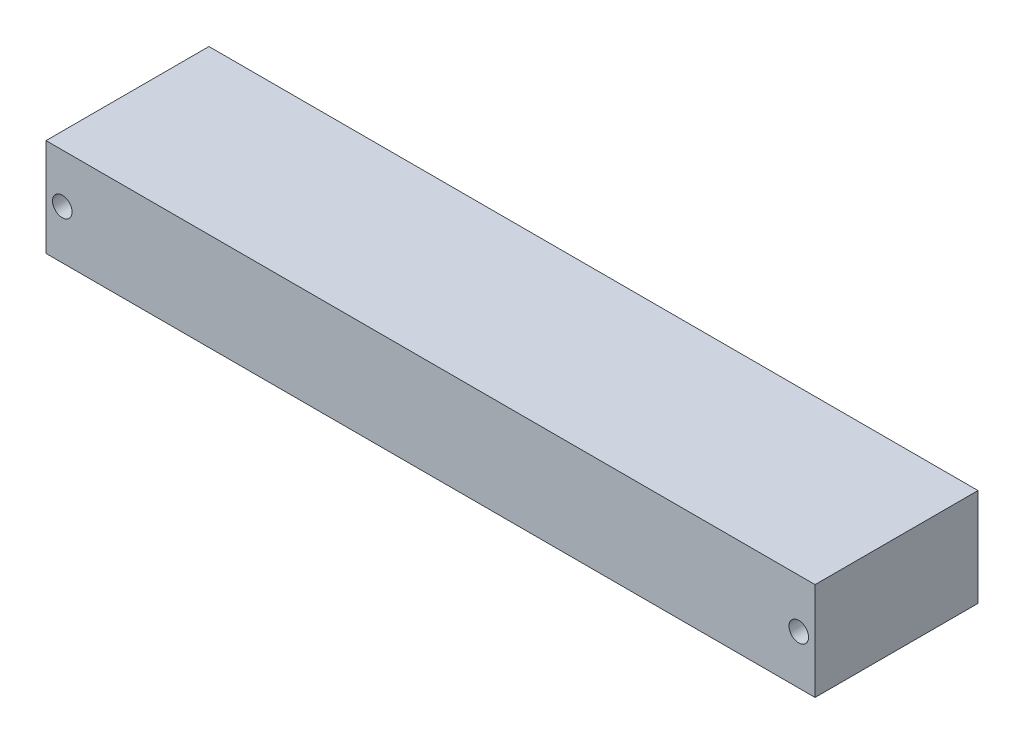
ISO-10303-21;
HEADER;
FILE_DESCRIPTION(('STEP AP214'),'2;1');
FILE_NAME('part.step','',(''),(''),'','','');
FILE_SCHEMA(('AUTOMOTIVE_DESIGN { 1 0 10303 214 1 1 1 1 }'));
ENDSEC;
DATA;
#1=APPLICATION_CONTEXT('core data for automotive mechanical design processes');
#2=APPLICATION_PROTOCOL_DEFINITION('international standard','automotive_design',2000,#1);
#3=PRODUCT_CONTEXT('',#1,'mechanical');
#4=PRODUCT('Part','Part','',(#3));
#5=PRODUCT_RELATED_PRODUCT_CATEGORY('part','',(#4));
#6=PRODUCT_DEFINITION_FORMATION('','',#4);
#7=PRODUCT_DEFINITION_CONTEXT('part definition',#1,'design');
#8=PRODUCT_DEFINITION('design','',#6,#7);
#9=PRODUCT_DEFINITION_SHAPE('','',#8);
#10=(LENGTH_UNIT() NAMED_UNIT(*) SI_UNIT(.MILLI.,.METRE.));
#11=(NAMED_UNIT(*) PLANE_ANGLE_UNIT() SI_UNIT($,.RADIAN.));
#12=(NAMED_UNIT(*) SI_UNIT($,.STERADIAN.) SOLID_ANGLE_UNIT());
#13=UNCERTAINTY_MEASURE_WITH_UNIT(LENGTH_MEASURE(1.E-05),#10,'distance_accuracy_value','');
#14=(GEOMETRIC_REPRESENTATION_CONTEXT(3) GLOBAL_UNCERTAINTY_ASSIGNED_CONTEXT((#13)) GLOBAL_UNIT_ASSIGNED_CONTEXT((#10,
#11,#12)) REPRESENTATION_CONTEXT('',''));
#15=CARTESIAN_POINT('',(0.,0.,0.));
#16=DIRECTION('',(0.,0.,1.));
#17=DIRECTION('',(1.,0.,0.));
#18=AXIS2_PLACEMENT_3D('',#15,#16,#17);
#19=CARTESIAN_POINT('',(59.,15.,-12.5));
#20=DIRECTION('',(-1.,0.,0.));
#21=DIRECTION('',(0.,0.,1.));
#22=AXIS2_PLACEMENT_3D('',#19,#20,#21);
#23=PLANE('',#22);
#24=DIRECTION('',(0.,0.,-1.));
#25=VECTOR('',#24,1.);
#26=CARTESIAN_POINT('',(59.,0.,-12.5));
#27=LINE('',#26,#25);
#28=CARTESIAN_POINT('',(59.,0.,12.5));
#29=VERTEX_POINT('',#28);
#30=CARTESIAN_POINT('',(59.,0.,-12.5));
#31=VERTEX_POINT('',#30);
#32=EDGE_CURVE('E101',#29,#31,#27,.T.);
#33=ORIENTED_EDGE('',*,*,#32,.T.);
#34=DIRECTION('',(0.,-1.,0.));
#35=VECTOR('',#34,1.);
#36=CARTESIAN_POINT('',(59.,15.,-12.5));
#37=LINE('',#36,#35);
#38=CARTESIAN_POINT('',(59.,15.,-12.5));
#39=VERTEX_POINT('',#38);
#40=EDGE_CURVE('E11',#39,#31,#37,.T.);
#41=ORIENTED_EDGE('',*,*,#40,.F.);
#42=DIRECTION('',(0.,0.,-1.));
#43=VECTOR('',#42,1.);
#44=CARTESIAN_POINT('',(59.,15.,-12.5));
#45=LINE('',#44,#43);
#46=CARTESIAN_POINT('',(59.,15.,12.5));
#47=VERTEX_POINT('',#46);
#48=EDGE_CURVE('E89',#47,#39,#45,.T.);
#49=ORIENTED_EDGE('',*,*,#48,.F.);
#50=DIRECTION('',(0.,-1.,0.));
#51=VECTOR('',#50,1.);
#52=CARTESIAN_POINT('',(59.,15.,12.5));
#53=LINE('',#52,#51);
#54=EDGE_CURVE('E97',#47,#29,#53,.T.);
#55=ORIENTED_EDGE('',*,*,#54,.T.);
#56=EDGE_LOOP('',(#33,#41,#49,#55));
#57=FACE_BOUND('',#56,.T.);
#58=ADVANCED_FACE('F38',(#57),#23,.F.);
#59=CARTESIAN_POINT('',(-59.,15.,-12.5));
#60=DIRECTION('',(0.,0.,1.));
#61=DIRECTION('',(1.,0.,0.));
#62=AXIS2_PLACEMENT_3D('',#59,#60,#61);
#63=PLANE('',#62);
#64=CARTESIAN_POINT('',(-56.5,7.5,-12.5));
#65=DIRECTION('',(0.,0.,1.));
#66=DIRECTION('',(1.,0.,0.));
#67=AXIS2_PLACEMENT_3D('',#64,#65,#66);
#68=CIRCLE('',#67,1.5);
#69=CARTESIAN_POINT('',(-55.,7.5,-12.5));
#70=VERTEX_POINT('',#69);
#71=EDGE_CURVE('E104',#70,#70,#68,.T.);
#72=ORIENTED_EDGE('',*,*,#71,.T.);
#73=EDGE_LOOP('',(#72));
#74=FACE_BOUND('',#73,.T.);
#75=CARTESIAN_POINT('',(56.5,7.5000000000001,-12.5));
#76=DIRECTION('',(0.,0.,1.));
#77=DIRECTION('',(1.,0.,0.));
#78=AXIS2_PLACEMENT_3D('',#75,#76,#77);
#79=CIRCLE('',#78,1.5);
#80=CARTESIAN_POINT('',(58.,7.5000000000001,-12.5));
#81=VERTEX_POINT('',#80);
#82=EDGE_CURVE('E117',#81,#81,#79,.T.);
#83=ORIENTED_EDGE('',*,*,#82,.T.);
#84=EDGE_LOOP('',(#83));
#85=FACE_BOUND('',#84,.T.);
#86=DIRECTION('',(-1.,0.,0.));
#87=VECTOR('',#86,1.);
#88=CARTESIAN_POINT('',(-59.,0.,-12.5));
#89=LINE('',#88,#87);
#90=CARTESIAN_POINT('',(-59.,0.,-12.5));
#91=VERTEX_POINT('',#90);
#92=EDGE_CURVE('E93',#31,#91,#89,.T.);
#93=ORIENTED_EDGE('',*,*,#92,.T.);
#94=DIRECTION('',(0.,-1.,0.));
#95=VECTOR('',#94,1.);
#96=CARTESIAN_POINT('',(-59.,15.,-12.5));
#97=LINE('',#96,#95);
#98=CARTESIAN_POINT('',(-59.,15.,-12.5));
#99=VERTEX_POINT('',#98);
#100=EDGE_CURVE('E46',#99,#91,#97,.T.);
#101=ORIENTED_EDGE('',*,*,#100,.F.);
#102=DIRECTION('',(-1.,0.,0.));
#103=VECTOR('',#102,1.);
#104=CARTESIAN_POINT('',(-59.,15.,-12.5));
#105=LINE('',#104,#103);
#106=EDGE_CURVE('E84',#39,#99,#105,.T.);
#107=ORIENTED_EDGE('',*,*,#106,.F.);
#108=ORIENTED_EDGE('',*,*,#40,.T.);
#109=EDGE_LOOP('',(#93,#101,#107,#108));
#110=FACE_BOUND('',#109,.T.);
#111=ADVANCED_FACE('F92',(#74,#85,#110),#63,.F.);
#112=CARTESIAN_POINT('',(-59.,15.,-12.5));
#113=DIRECTION('',(1.,0.,0.));
#114=DIRECTION('',(0.,0.,-1.));
#115=AXIS2_PLACEMENT_3D('',#112,#113,#114);
#116=PLANE('',#115);
#117=DIRECTION('',(0.,0.,1.));
#118=VECTOR('',#117,1.);
#119=CARTESIAN_POINT('',(-59.,0.,-12.5));
#120=LINE('',#119,#118);
#121=CARTESIAN_POINT('',(-59.,0.,12.5));
#122=VERTEX_POINT('',#121);
#123=EDGE_CURVE('E71',#91,#122,#120,.T.);
#124=ORIENTED_EDGE('',*,*,#123,.T.);
#125=DIRECTION('',(0.,-1.,0.));
#126=VECTOR('',#125,1.);
#127=CARTESIAN_POINT('',(-59.,15.,12.5));
#128=LINE('',#127,#126);
#129=CARTESIAN_POINT('',(-59.,15.,12.5));
#130=VERTEX_POINT('',#129);
#131=EDGE_CURVE('E94',#130,#122,#128,.T.);
#132=ORIENTED_EDGE('',*,*,#131,.F.);
#133=DIRECTION('',(0.,0.,1.));
#134=VECTOR('',#133,1.);
#135=CARTESIAN_POINT('',(-59.,15.,-12.5));
#136=LINE('',#135,#134);
#137=EDGE_CURVE('E87',#99,#130,#136,.T.);
#138=ORIENTED_EDGE('',*,*,#137,.F.);
#139=ORIENTED_EDGE('',*,*,#100,.T.);
#140=EDGE_LOOP('',(#124,#132,#138,#139));
#141=FACE_BOUND('',#140,.T.);
#142=ADVANCED_FACE('F95',(#141),#116,.F.);
#143=CARTESIAN_POINT('',(-59.,15.,12.5));
#144=DIRECTION('',(0.,0.,-1.));
#145=DIRECTION('',(-1.,0.,0.));
#146=AXIS2_PLACEMENT_3D('',#143,#144,#145);
#147=PLANE('',#146);
#148=CARTESIAN_POINT('',(-56.5,7.5,12.5));
#149=DIRECTION('',(0.,0.,1.));
#150=DIRECTION('',(1.,0.,0.));
#151=AXIS2_PLACEMENT_3D('',#148,#149,#150);
#152=CIRCLE('',#151,1.5);
#153=CARTESIAN_POINT('',(-55.,7.5,12.5));
#154=VERTEX_POINT('',#153);
#155=EDGE_CURVE('E120',#154,#154,#152,.T.);
#156=ORIENTED_EDGE('',*,*,#155,.F.);
#157=EDGE_LOOP('',(#156));
#158=FACE_BOUND('',#157,.T.);
#159=CARTESIAN_POINT('',(56.5,7.5000000000001,12.5));
#160=DIRECTION('',(0.,0.,1.));
#161=DIRECTION('',(-1.,0.,0.));
#162=AXIS2_PLACEMENT_3D('',#159,#160,#161);
#163=CIRCLE('',#162,1.5);
#164=CARTESIAN_POINT('',(55.,7.5000000000001,12.5));
#165=VERTEX_POINT('',#164);
#166=EDGE_CURVE('E121',#165,#165,#163,.T.);
#167=ORIENTED_EDGE('',*,*,#166,.F.);
#168=EDGE_LOOP('',(#167));
#169=FACE_BOUND('',#168,.T.);
#170=DIRECTION('',(1.,0.,0.));
#171=VECTOR('',#170,1.);
#172=CARTESIAN_POINT('',(-59.,0.,12.5));
#173=LINE('',#172,#171);
#174=EDGE_CURVE('E77',#122,#29,#173,.T.);
#175=ORIENTED_EDGE('',*,*,#174,.T.);
#176=ORIENTED_EDGE('',*,*,#54,.F.);
#177=DIRECTION('',(1.,0.,0.));
#178=VECTOR('',#177,1.);
#179=CARTESIAN_POINT('',(-59.,15.,12.5));
#180=LINE('',#179,#178);
#181=EDGE_CURVE('E54',#130,#47,#180,.T.);
#182=ORIENTED_EDGE('',*,*,#181,.F.);
#183=ORIENTED_EDGE('',*,*,#131,.T.);
#184=EDGE_LOOP('',(#175,#176,#182,#183));
#185=FACE_BOUND('',#184,.T.);
#186=ADVANCED_FACE('F109',(#158,#169,#185),#147,.F.);
#187=CARTESIAN_POINT('',(0.,15.,0.));
#188=DIRECTION('',(0.,1.,0.));
#189=DIRECTION('',(0.,0.,1.));
#190=AXIS2_PLACEMENT_3D('',#187,#188,#189);
#191=PLANE('',#190);
#192=ORIENTED_EDGE('',*,*,#48,.T.);
#193=ORIENTED_EDGE('',*,*,#106,.T.);
#194=ORIENTED_EDGE('',*,*,#137,.T.);
#195=ORIENTED_EDGE('',*,*,#181,.T.);
#196=EDGE_LOOP('',(#192,#193,#194,#195));
#197=FACE_BOUND('',#196,.T.);
#198=ADVANCED_FACE('F85',(#197),#191,.T.);
#199=CARTESIAN_POINT('',(0.,0.,0.));
#200=DIRECTION('',(0.,1.,0.));
#201=DIRECTION('',(0.,0.,1.));
#202=AXIS2_PLACEMENT_3D('',#199,#200,#201);
#203=PLANE('',#202);
#204=ORIENTED_EDGE('',*,*,#32,.F.);
#205=ORIENTED_EDGE('',*,*,#174,.F.);
#206=ORIENTED_EDGE('',*,*,#123,.F.);
#207=ORIENTED_EDGE('',*,*,#92,.F.);
#208=EDGE_LOOP('',(#204,#205,#206,#207));
#209=FACE_BOUND('',#208,.T.);
#210=ADVANCED_FACE('F112',(#209),#203,.F.);
#211=CARTESIAN_POINT('',(56.5,7.5000000000001,-24.5));
#212=DIRECTION('',(0.,0.,1.));
#213=DIRECTION('',(1.,0.,0.));
#214=AXIS2_PLACEMENT_3D('',#211,#212,#213);
#215=CYLINDRICAL_SURFACE('',#214,1.5);
#216=ORIENTED_EDGE('',*,*,#166,.T.);
#217=EDGE_LOOP('',(#216));
#218=FACE_BOUND('',#217,.T.);
#219=ORIENTED_EDGE('',*,*,#82,.F.);
#220=EDGE_LOOP('',(#219));
#221=FACE_BOUND('',#220,.T.);
#222=ADVANCED_FACE('F135',(#218,#221),#215,.F.);
#223=CARTESIAN_POINT('',(-56.5,7.5,-24.5));
#224=DIRECTION('',(0.,0.,1.));
#225=DIRECTION('',(1.,0.,0.));
#226=AXIS2_PLACEMENT_3D('',#223,#224,#225);
#227=CYLINDRICAL_SURFACE('',#226,1.5);
#228=ORIENTED_EDGE('',*,*,#155,.T.);
#229=EDGE_LOOP('',(#228));
#230=FACE_BOUND('',#229,.T.);
#231=ORIENTED_EDGE('',*,*,#71,.F.);
#232=EDGE_LOOP('',(#231));
#233=FACE_BOUND('',#232,.T.);
#234=ADVANCED_FACE('F127',(#230,#233),#227,.F.);
#235=CLOSED_SHELL('',(#58,#111,#142,#186,#198,#210,#222,#234));
#236=MANIFOLD_SOLID_BREP('B2',#235);
#237=ADVANCED_BREP_SHAPE_REPRESENTATION('',(#18,#236),#14);
#238=SHAPE_DEFINITION_REPRESENTATION(#9,#237);
ENDSEC;
END-ISO-10303-21;
